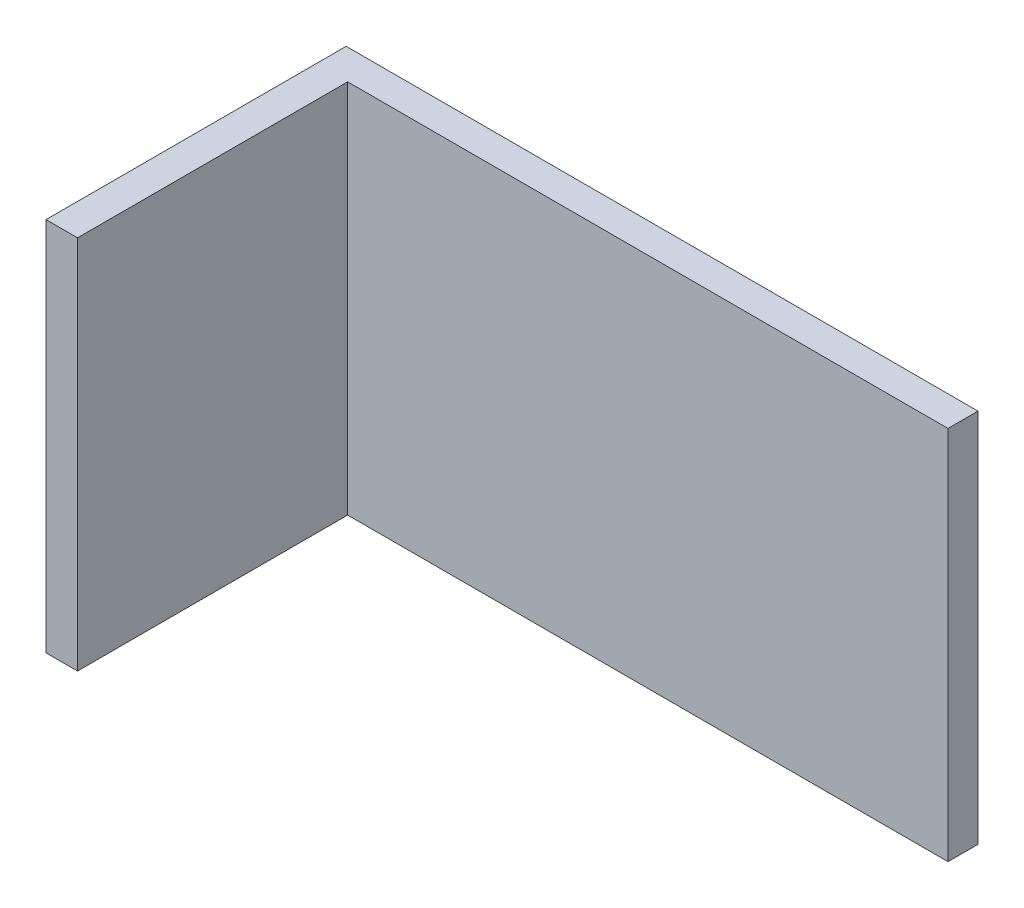
ISO-10303-21;
HEADER;
FILE_DESCRIPTION(('STEP AP214'),'2;1');
FILE_NAME('part.step','',(''),(''),'','','');
FILE_SCHEMA(('AUTOMOTIVE_DESIGN { 1 0 10303 214 1 1 1 1 }'));
ENDSEC;
DATA;
#1=APPLICATION_CONTEXT('core data for automotive mechanical design processes');
#2=APPLICATION_PROTOCOL_DEFINITION('international standard','automotive_design',2000,#1);
#3=PRODUCT_CONTEXT('',#1,'mechanical');
#4=PRODUCT('Part','Part','',(#3));
#5=PRODUCT_RELATED_PRODUCT_CATEGORY('part','',(#4));
#6=PRODUCT_DEFINITION_FORMATION('','',#4);
#7=PRODUCT_DEFINITION_CONTEXT('part definition',#1,'design');
#8=PRODUCT_DEFINITION('design','',#6,#7);
#9=PRODUCT_DEFINITION_SHAPE('','',#8);
#10=(LENGTH_UNIT() NAMED_UNIT(*) SI_UNIT(.MILLI.,.METRE.));
#11=(NAMED_UNIT(*) PLANE_ANGLE_UNIT() SI_UNIT($,.RADIAN.));
#12=(NAMED_UNIT(*) SI_UNIT($,.STERADIAN.) SOLID_ANGLE_UNIT());
#13=UNCERTAINTY_MEASURE_WITH_UNIT(LENGTH_MEASURE(1.E-05),#10,'distance_accuracy_value','');
#14=(GEOMETRIC_REPRESENTATION_CONTEXT(3) GLOBAL_UNCERTAINTY_ASSIGNED_CONTEXT((#13)) GLOBAL_UNIT_ASSIGNED_CONTEXT((#10,
#11,#12)) REPRESENTATION_CONTEXT('',''));
#15=CARTESIAN_POINT('',(0.,0.,0.));
#16=DIRECTION('',(0.,0.,1.));
#17=DIRECTION('',(1.,0.,0.));
#18=AXIS2_PLACEMENT_3D('',#15,#16,#17);
#19=CARTESIAN_POINT('',(-1.53882069959544,0.25,0.2));
#20=DIRECTION('',(0.,0.,1.));
#21=DIRECTION('',(1.,0.,0.));
#22=AXIS2_PLACEMENT_3D('',#19,#20,#21);
#23=PLANE('',#22);
#24=DIRECTION('',(0.,-1.,0.));
#25=VECTOR('',#24,1.);
#26=CARTESIAN_POINT('',(-1.54932069959544,0.25,0.2));
#27=LINE('',#26,#25);
#28=CARTESIAN_POINT('',(-1.54932069959544,0.375,0.2));
#29=VERTEX_POINT('',#28);
#30=CARTESIAN_POINT('',(-1.54932069959544,0.125,0.2));
#31=VERTEX_POINT('',#30);
#32=EDGE_CURVE('E19',#29,#31,#27,.T.);
#33=ORIENTED_EDGE('',*,*,#32,.T.);
#34=DIRECTION('',(1.,0.,0.));
#35=VECTOR('',#34,1.);
#36=CARTESIAN_POINT('',(-1.39679171408819,0.125,0.2));
#37=LINE('',#36,#35);
#38=CARTESIAN_POINT('',(-1.52832069959544,0.125,0.2));
#39=VERTEX_POINT('',#38);
#40=EDGE_CURVE('E112',#31,#39,#37,.T.);
#41=ORIENTED_EDGE('',*,*,#40,.T.);
#42=DIRECTION('',(0.,-1.,0.));
#43=VECTOR('',#42,1.);
#44=CARTESIAN_POINT('',(-1.52832069959544,0.25,0.2));
#45=LINE('',#44,#43);
#46=CARTESIAN_POINT('',(-1.52832069959544,0.375,0.2));
#47=VERTEX_POINT('',#46);
#48=EDGE_CURVE('E11',#47,#39,#45,.T.);
#49=ORIENTED_EDGE('',*,*,#48,.F.);
#50=DIRECTION('',(1.,0.,0.));
#51=VECTOR('',#50,1.);
#52=CARTESIAN_POINT('',(-1.39679171408819,0.375,0.2));
#53=LINE('',#52,#51);
#54=EDGE_CURVE('E142',#29,#47,#53,.T.);
#55=ORIENTED_EDGE('',*,*,#54,.F.);
#56=EDGE_LOOP('',(#33,#41,#49,#55));
#57=FACE_BOUND('',#56,.T.);
#58=ADVANCED_FACE('F16',(#57),#23,.T.);
#59=CARTESIAN_POINT('',(-1.52832069959544,0.25,0.11));
#60=DIRECTION('',(1.,0.,0.));
#61=DIRECTION('',(0.,0.,1.));
#62=AXIS2_PLACEMENT_3D('',#59,#60,#61);
#63=PLANE('',#62);
#64=DIRECTION('',(0.,0.,-1.));
#65=VECTOR('',#64,1.);
#66=CARTESIAN_POINT('',(-1.52832069959544,0.375,0.0420289855072459));
#67=LINE('',#66,#65);
#68=CARTESIAN_POINT('',(-1.52832069959544,0.375,0.02));
#69=VERTEX_POINT('',#68);
#70=EDGE_CURVE('E145',#47,#69,#67,.T.);
#71=ORIENTED_EDGE('',*,*,#70,.F.);
#72=ORIENTED_EDGE('',*,*,#48,.T.);
#73=DIRECTION('',(0.,0.,-1.));
#74=VECTOR('',#73,1.);
#75=CARTESIAN_POINT('',(-1.52832069959544,0.125,0.0420289855072459));
#76=LINE('',#75,#74);
#77=CARTESIAN_POINT('',(-1.52832069959544,0.125,0.02));
#78=VERTEX_POINT('',#77);
#79=EDGE_CURVE('E149',#39,#78,#76,.T.);
#80=ORIENTED_EDGE('',*,*,#79,.T.);
#81=DIRECTION('',(0.,-1.,0.));
#82=VECTOR('',#81,1.);
#83=CARTESIAN_POINT('',(-1.52832069959544,0.25,0.02));
#84=LINE('',#83,#82);
#85=EDGE_CURVE('E26',#69,#78,#84,.T.);
#86=ORIENTED_EDGE('',*,*,#85,.F.);
#87=EDGE_LOOP('',(#71,#72,#80,#86));
#88=FACE_BOUND('',#87,.T.);
#89=ADVANCED_FACE('F173',(#88),#63,.T.);
#90=CARTESIAN_POINT('',(-1.32832069959544,0.25,0.02));
#91=DIRECTION('',(0.,0.,1.));
#92=DIRECTION('',(1.,0.,0.));
#93=AXIS2_PLACEMENT_3D('',#90,#91,#92);
#94=PLANE('',#93);
#95=DIRECTION('',(1.,0.,0.));
#96=VECTOR('',#95,1.);
#97=CARTESIAN_POINT('',(-1.39679171408819,0.125,0.02));
#98=LINE('',#97,#96);
#99=CARTESIAN_POINT('',(-1.12832069959544,0.125,0.02));
#100=VERTEX_POINT('',#99);
#101=EDGE_CURVE('E139',#78,#100,#98,.T.);
#102=ORIENTED_EDGE('',*,*,#101,.T.);
#103=DIRECTION('',(0.,-1.,0.));
#104=VECTOR('',#103,1.);
#105=CARTESIAN_POINT('',(-1.12832069959544,0.25,0.02));
#106=LINE('',#105,#104);
#107=CARTESIAN_POINT('',(-1.12832069959544,0.375,0.02));
#108=VERTEX_POINT('',#107);
#109=EDGE_CURVE('E136',#108,#100,#106,.T.);
#110=ORIENTED_EDGE('',*,*,#109,.F.);
#111=DIRECTION('',(1.,0.,0.));
#112=VECTOR('',#111,1.);
#113=CARTESIAN_POINT('',(-1.39679171408819,0.375,0.02));
#114=LINE('',#113,#112);
#115=EDGE_CURVE('E70',#69,#108,#114,.T.);
#116=ORIENTED_EDGE('',*,*,#115,.F.);
#117=ORIENTED_EDGE('',*,*,#85,.T.);
#118=EDGE_LOOP('',(#102,#110,#116,#117));
#119=FACE_BOUND('',#118,.T.);
#120=ADVANCED_FACE('F178',(#119),#94,.T.);
#121=CARTESIAN_POINT('',(-1.39679171408819,0.375,0.0420289855072459));
#122=DIRECTION('',(0.,1.,0.));
#123=DIRECTION('',(1.,0.,0.));
#124=AXIS2_PLACEMENT_3D('',#121,#122,#123);
#125=PLANE('',#124);
#126=DIRECTION('',(0.,0.,1.));
#127=VECTOR('',#126,1.);
#128=CARTESIAN_POINT('',(-1.54932069959544,0.375,0.0999999999999988));
#129=LINE('',#128,#127);
#130=CARTESIAN_POINT('',(-1.54932069959544,0.375,0.));
#131=VERTEX_POINT('',#130);
#132=EDGE_CURVE('E87',#131,#29,#129,.T.);
#133=ORIENTED_EDGE('',*,*,#132,.T.);
#134=ORIENTED_EDGE('',*,*,#54,.T.);
#135=ORIENTED_EDGE('',*,*,#70,.T.);
#136=ORIENTED_EDGE('',*,*,#115,.T.);
#137=DIRECTION('',(0.,0.,1.));
#138=VECTOR('',#137,1.);
#139=CARTESIAN_POINT('',(-1.12832069959544,0.375,0.01));
#140=LINE('',#139,#138);
#141=CARTESIAN_POINT('',(-1.12832069959544,0.375,0.));
#142=VERTEX_POINT('',#141);
#143=EDGE_CURVE('E131',#142,#108,#140,.T.);
#144=ORIENTED_EDGE('',*,*,#143,.F.);
#145=DIRECTION('',(-1.,0.,0.));
#146=VECTOR('',#145,1.);
#147=CARTESIAN_POINT('',(-1.33882069959543,0.375,0.));
#148=LINE('',#147,#146);
#149=EDGE_CURVE('E121',#142,#131,#148,.T.);
#150=ORIENTED_EDGE('',*,*,#149,.T.);
#151=EDGE_LOOP('',(#133,#134,#135,#136,#144,#150));
#152=FACE_BOUND('',#151,.T.);
#153=ADVANCED_FACE('F187',(#152),#125,.T.);
#154=CARTESIAN_POINT('',(-1.54932069959544,0.25,0.0999999999999988));
#155=DIRECTION('',(1.,0.,0.));
#156=DIRECTION('',(0.,-1.,0.));
#157=AXIS2_PLACEMENT_3D('',#154,#155,#156);
#158=PLANE('',#157);
#159=DIRECTION('',(0.,-1.,0.));
#160=VECTOR('',#159,1.);
#161=CARTESIAN_POINT('',(-1.54932069959544,0.25,0.));
#162=LINE('',#161,#160);
#163=CARTESIAN_POINT('',(-1.54932069959544,0.125,0.));
#164=VERTEX_POINT('',#163);
#165=EDGE_CURVE('E116',#131,#164,#162,.T.);
#166=ORIENTED_EDGE('',*,*,#165,.T.);
#167=DIRECTION('',(0.,0.,1.));
#168=VECTOR('',#167,1.);
#169=CARTESIAN_POINT('',(-1.54932069959544,0.125,0.0420289855072459));
#170=LINE('',#169,#168);
#171=EDGE_CURVE('E105',#164,#31,#170,.T.);
#172=ORIENTED_EDGE('',*,*,#171,.T.);
#173=ORIENTED_EDGE('',*,*,#32,.F.);
#174=ORIENTED_EDGE('',*,*,#132,.F.);
#175=EDGE_LOOP('',(#166,#172,#173,#174));
#176=FACE_BOUND('',#175,.T.);
#177=ADVANCED_FACE('F117',(#176),#158,.F.);
#178=CARTESIAN_POINT('',(-1.39679171408819,0.125,0.0420289855072459));
#179=DIRECTION('',(0.,1.,0.));
#180=DIRECTION('',(0.,0.,-1.));
#181=AXIS2_PLACEMENT_3D('',#178,#179,#180);
#182=PLANE('',#181);
#183=ORIENTED_EDGE('',*,*,#101,.F.);
#184=ORIENTED_EDGE('',*,*,#79,.F.);
#185=ORIENTED_EDGE('',*,*,#40,.F.);
#186=ORIENTED_EDGE('',*,*,#171,.F.);
#187=DIRECTION('',(1.,0.,0.));
#188=VECTOR('',#187,1.);
#189=CARTESIAN_POINT('',(-1.33882069959543,0.125,0.));
#190=LINE('',#189,#188);
#191=CARTESIAN_POINT('',(-1.12832069959544,0.125,0.));
#192=VERTEX_POINT('',#191);
#193=EDGE_CURVE('E109',#164,#192,#190,.T.);
#194=ORIENTED_EDGE('',*,*,#193,.T.);
#195=DIRECTION('',(0.,0.,-1.));
#196=VECTOR('',#195,1.);
#197=CARTESIAN_POINT('',(-1.12832069959544,0.125,0.01));
#198=LINE('',#197,#196);
#199=EDGE_CURVE('E96',#100,#192,#198,.T.);
#200=ORIENTED_EDGE('',*,*,#199,.F.);
#201=EDGE_LOOP('',(#183,#184,#185,#186,#194,#200));
#202=FACE_BOUND('',#201,.T.);
#203=ADVANCED_FACE('F107',(#202),#182,.F.);
#204=CARTESIAN_POINT('',(-1.12832069959544,0.25,0.01));
#205=DIRECTION('',(1.,0.,0.));
#206=DIRECTION('',(0.,0.,-1.));
#207=AXIS2_PLACEMENT_3D('',#204,#205,#206);
#208=PLANE('',#207);
#209=ORIENTED_EDGE('',*,*,#199,.T.);
#210=DIRECTION('',(0.,1.,0.));
#211=VECTOR('',#210,1.);
#212=CARTESIAN_POINT('',(-1.12832069959544,0.25,0.));
#213=LINE('',#212,#211);
#214=EDGE_CURVE('E124',#192,#142,#213,.T.);
#215=ORIENTED_EDGE('',*,*,#214,.T.);
#216=ORIENTED_EDGE('',*,*,#143,.T.);
#217=ORIENTED_EDGE('',*,*,#109,.T.);
#218=EDGE_LOOP('',(#209,#215,#216,#217));
#219=FACE_BOUND('',#218,.T.);
#220=ADVANCED_FACE('F201',(#219),#208,.T.);
#221=CARTESIAN_POINT('',(-1.33882069959543,0.25,0.));
#222=DIRECTION('',(0.,0.,1.));
#223=DIRECTION('',(1.,0.,0.));
#224=AXIS2_PLACEMENT_3D('',#221,#222,#223);
#225=PLANE('',#224);
#226=ORIENTED_EDGE('',*,*,#193,.F.);
#227=ORIENTED_EDGE('',*,*,#165,.F.);
#228=ORIENTED_EDGE('',*,*,#149,.F.);
#229=ORIENTED_EDGE('',*,*,#214,.F.);
#230=EDGE_LOOP('',(#226,#227,#228,#229));
#231=FACE_BOUND('',#230,.T.);
#232=ADVANCED_FACE('F123',(#231),#225,.F.);
#233=CLOSED_SHELL('',(#58,#89,#120,#153,#177,#203,#220,#232));
#234=MANIFOLD_SOLID_BREP('B1',#233);
#235=ADVANCED_BREP_SHAPE_REPRESENTATION('',(#18,#234),#14);
#236=SHAPE_DEFINITION_REPRESENTATION(#9,#235);
ENDSEC;
END-ISO-10303-21;
